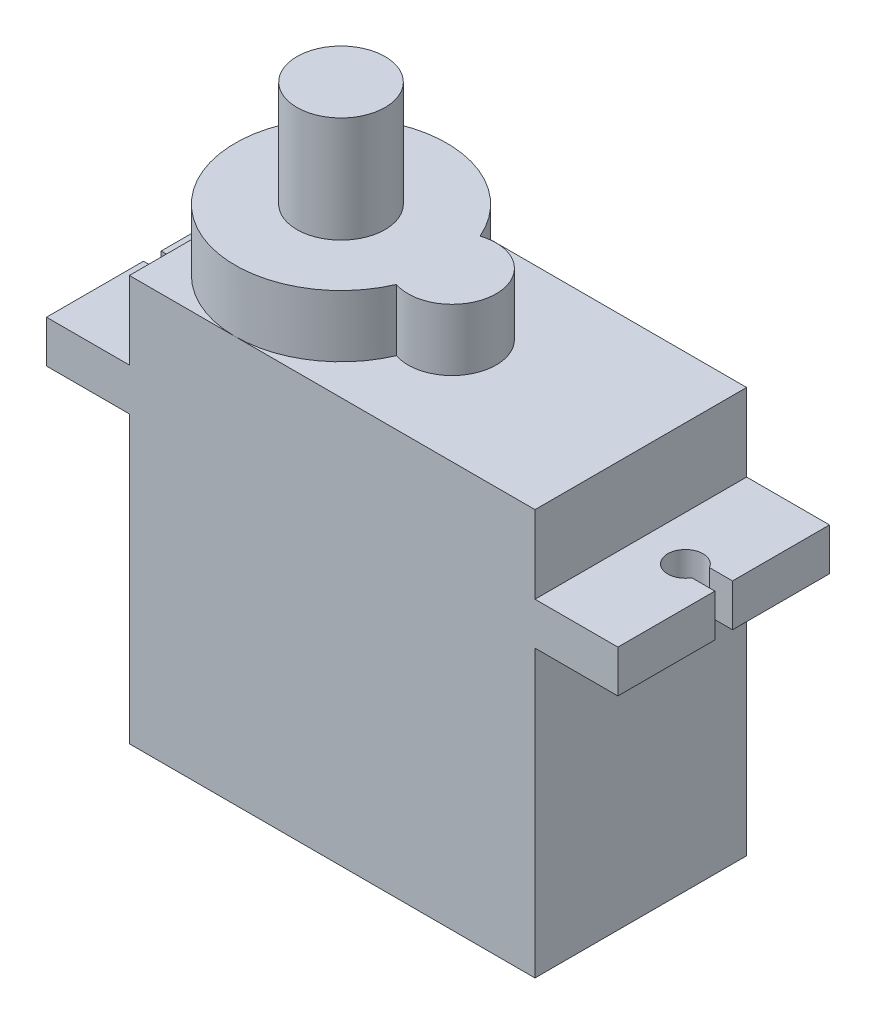
ISO-10303-21;
HEADER;
FILE_DESCRIPTION(('STEP AP214'),'2;1');
FILE_NAME('part.step','',(''),(''),'','','');
FILE_SCHEMA(('AUTOMOTIVE_DESIGN { 1 0 10303 214 1 1 1 1 }'));
ENDSEC;
DATA;
#1=APPLICATION_CONTEXT('core data for automotive mechanical design processes');
#2=APPLICATION_PROTOCOL_DEFINITION('international standard','automotive_design',2000,#1);
#3=PRODUCT_CONTEXT('',#1,'mechanical');
#4=PRODUCT('Part','Part','',(#3));
#5=PRODUCT_RELATED_PRODUCT_CATEGORY('part','',(#4));
#6=PRODUCT_DEFINITION_FORMATION('','',#4);
#7=PRODUCT_DEFINITION_CONTEXT('part definition',#1,'design');
#8=PRODUCT_DEFINITION('design','',#6,#7);
#9=PRODUCT_DEFINITION_SHAPE('','',#8);
#10=(LENGTH_UNIT() NAMED_UNIT(*) SI_UNIT(.MILLI.,.METRE.));
#11=(NAMED_UNIT(*) PLANE_ANGLE_UNIT() SI_UNIT($,.RADIAN.));
#12=(NAMED_UNIT(*) SI_UNIT($,.STERADIAN.) SOLID_ANGLE_UNIT());
#13=UNCERTAINTY_MEASURE_WITH_UNIT(LENGTH_MEASURE(1.E-05),#10,'distance_accuracy_value','');
#14=(GEOMETRIC_REPRESENTATION_CONTEXT(3) GLOBAL_UNCERTAINTY_ASSIGNED_CONTEXT((#13)) GLOBAL_UNIT_ASSIGNED_CONTEXT((#10,
#11,#12)) REPRESENTATION_CONTEXT('',''));
#15=CARTESIAN_POINT('',(0.,0.,0.));
#16=DIRECTION('',(0.,0.,1.));
#17=DIRECTION('',(1.,0.,0.));
#18=AXIS2_PLACEMENT_3D('',#15,#16,#17);
#19=CARTESIAN_POINT('',(-11.5,-23.,6.));
#20=DIRECTION('',(-1.,0.,0.));
#21=DIRECTION('',(0.,0.,1.));
#22=AXIS2_PLACEMENT_3D('',#19,#20,#21);
#23=PLANE('',#22);
#24=DIRECTION('',(0.,0.,1.));
#25=VECTOR('',#24,1.);
#26=CARTESIAN_POINT('',(-11.5,-6.8,0.));
#27=LINE('',#26,#25);
#28=CARTESIAN_POINT('',(-11.5,-6.8,-6.));
#29=VERTEX_POINT('',#28);
#30=CARTESIAN_POINT('',(-11.5,-6.8,6.));
#31=VERTEX_POINT('',#30);
#32=EDGE_CURVE('E336',#29,#31,#27,.T.);
#33=ORIENTED_EDGE('',*,*,#32,.F.);
#34=DIRECTION('',(0.,1.,0.));
#35=VECTOR('',#34,1.);
#36=CARTESIAN_POINT('',(-11.5,-23.,-6.));
#37=LINE('',#36,#35);
#38=CARTESIAN_POINT('',(-11.5,-23.,-6.));
#39=VERTEX_POINT('',#38);
#40=EDGE_CURVE('E412',#39,#29,#37,.T.);
#41=ORIENTED_EDGE('',*,*,#40,.F.);
#42=DIRECTION('',(0.,0.,1.));
#43=VECTOR('',#42,1.);
#44=CARTESIAN_POINT('',(-11.5,-23.,6.));
#45=LINE('',#44,#43);
#46=CARTESIAN_POINT('',(-11.5,-23.,6.));
#47=VERTEX_POINT('',#46);
#48=EDGE_CURVE('E385',#39,#47,#45,.T.);
#49=ORIENTED_EDGE('',*,*,#48,.T.);
#50=DIRECTION('',(0.,1.,0.));
#51=VECTOR('',#50,1.);
#52=CARTESIAN_POINT('',(-11.5,-23.,6.));
#53=LINE('',#52,#51);
#54=EDGE_CURVE('E409',#47,#31,#53,.T.);
#55=ORIENTED_EDGE('',*,*,#54,.T.);
#56=EDGE_LOOP('',(#33,#41,#49,#55));
#57=FACE_BOUND('',#56,.T.);
#58=DIRECTION('',(0.,0.,1.));
#59=VECTOR('',#58,1.);
#60=CARTESIAN_POINT('',(-11.5,-18.,-1.5));
#61=LINE('',#60,#59);
#62=CARTESIAN_POINT('',(-11.5,-18.,-1.5));
#63=VERTEX_POINT('',#62);
#64=CARTESIAN_POINT('',(-11.5,-18.,1.5));
#65=VERTEX_POINT('',#64);
#66=EDGE_CURVE('E598',#63,#65,#61,.T.);
#67=ORIENTED_EDGE('',*,*,#66,.F.);
#68=DIRECTION('',(0.,-1.,0.));
#69=VECTOR('',#68,1.);
#70=CARTESIAN_POINT('',(-11.5,-17.,-1.5));
#71=LINE('',#70,#69);
#72=CARTESIAN_POINT('',(-11.5,-17.,-1.5));
#73=VERTEX_POINT('',#72);
#74=EDGE_CURVE('E248',#73,#63,#71,.T.);
#75=ORIENTED_EDGE('',*,*,#74,.F.);
#76=DIRECTION('',(0.,0.,-1.));
#77=VECTOR('',#76,1.);
#78=CARTESIAN_POINT('',(-11.5,-17.,-1.5));
#79=LINE('',#78,#77);
#80=CARTESIAN_POINT('',(-11.5,-17.,1.5));
#81=VERTEX_POINT('',#80);
#82=EDGE_CURVE('E244',#81,#73,#79,.T.);
#83=ORIENTED_EDGE('',*,*,#82,.F.);
#84=DIRECTION('',(0.,1.,0.));
#85=VECTOR('',#84,1.);
#86=CARTESIAN_POINT('',(-11.5,-17.,1.5));
#87=LINE('',#86,#85);
#88=EDGE_CURVE('E605',#65,#81,#87,.T.);
#89=ORIENTED_EDGE('',*,*,#88,.F.);
#90=EDGE_LOOP('',(#67,#75,#83,#89));
#91=FACE_BOUND('',#90,.T.);
#92=ADVANCED_FACE('F43',(#57,#91),#23,.T.);
#93=CARTESIAN_POINT('',(0.,3.5,0.));
#94=DIRECTION('',(0.,1.,0.));
#95=DIRECTION('',(0.,0.,1.));
#96=AXIS2_PLACEMENT_3D('',#93,#94,#95);
#97=PLANE('',#96);
#98=CARTESIAN_POINT('',(-5.5,3.5,0.));
#99=DIRECTION('',(0.,1.,0.));
#100=DIRECTION('',(0.,0.,1.));
#101=AXIS2_PLACEMENT_3D('',#98,#99,#100);
#102=CIRCLE('',#101,2.5);
#103=CARTESIAN_POINT('',(-5.5,3.5,2.5));
#104=VERTEX_POINT('',#103);
#105=EDGE_CURVE('E11',#104,#104,#102,.T.);
#106=ORIENTED_EDGE('',*,*,#105,.F.);
#107=EDGE_LOOP('',(#106));
#108=FACE_BOUND('',#107,.T.);
#109=CARTESIAN_POINT('',(-5.5,3.5,0.));
#110=DIRECTION('',(0.,1.,0.));
#111=DIRECTION('',(0.,0.,1.));
#112=AXIS2_PLACEMENT_3D('',#109,#110,#111);
#113=CIRCLE('',#112,6.);
#114=CARTESIAN_POINT('',(0.0111111111111162,3.5,-2.37226775912578));
#115=VERTEX_POINT('',#114);
#116=CARTESIAN_POINT('',(0.0111111111111162,3.5,2.37226775912578));
#117=VERTEX_POINT('',#116);
#118=EDGE_CURVE('E258',#115,#117,#113,.T.);
#119=ORIENTED_EDGE('',*,*,#118,.T.);
#120=CARTESIAN_POINT('',(0.800000000000004,3.5,0.));
#121=DIRECTION('',(0.,1.,0.));
#122=DIRECTION('',(0.,0.,1.));
#123=AXIS2_PLACEMENT_3D('',#120,#121,#122);
#124=CIRCLE('',#123,2.5);
#125=EDGE_CURVE('E261',#117,#115,#124,.T.);
#126=ORIENTED_EDGE('',*,*,#125,.T.);
#127=EDGE_LOOP('',(#119,#126));
#128=FACE_BOUND('',#127,.T.);
#129=ADVANCED_FACE('F498',(#108,#128),#97,.T.);
#130=CARTESIAN_POINT('',(0.,0.,0.));
#131=DIRECTION('',(0.,-1.,0.));
#132=DIRECTION('',(0.,0.,-1.));
#133=AXIS2_PLACEMENT_3D('',#130,#131,#132);
#134=PLANE('',#133);
#135=CARTESIAN_POINT('',(-5.5,0.,0.));
#136=DIRECTION('',(0.,1.,0.));
#137=DIRECTION('',(0.,0.,1.));
#138=AXIS2_PLACEMENT_3D('',#135,#136,#137);
#139=CIRCLE('',#138,6.);
#140=CARTESIAN_POINT('',(0.0111111111111162,0.,-2.37226775912578));
#141=VERTEX_POINT('',#140);
#142=CARTESIAN_POINT('',(-5.5,0.,-6.));
#143=VERTEX_POINT('',#142);
#144=EDGE_CURVE('E250',#141,#143,#139,.T.);
#145=ORIENTED_EDGE('',*,*,#144,.F.);
#146=CARTESIAN_POINT('',(0.800000000000004,0.,0.));
#147=DIRECTION('',(0.,1.,0.));
#148=DIRECTION('',(0.,0.,1.));
#149=AXIS2_PLACEMENT_3D('',#146,#147,#148);
#150=CIRCLE('',#149,2.5);
#151=CARTESIAN_POINT('',(0.0111111111111162,0.,2.37226775912578));
#152=VERTEX_POINT('',#151);
#153=EDGE_CURVE('E66',#152,#141,#150,.T.);
#154=ORIENTED_EDGE('',*,*,#153,.F.);
#155=CARTESIAN_POINT('',(-5.5,0.,6.));
#156=VERTEX_POINT('',#155);
#157=EDGE_CURVE('E254',#156,#152,#139,.T.);
#158=ORIENTED_EDGE('',*,*,#157,.F.);
#159=DIRECTION('',(1.,0.,0.));
#160=VECTOR('',#159,1.);
#161=CARTESIAN_POINT('',(-11.5,0.,6.));
#162=LINE('',#161,#160);
#163=CARTESIAN_POINT('',(11.5,0.,6.));
#164=VERTEX_POINT('',#163);
#165=EDGE_CURVE('E402',#156,#164,#162,.T.);
#166=ORIENTED_EDGE('',*,*,#165,.T.);
#167=DIRECTION('',(0.,0.,-1.));
#168=VECTOR('',#167,1.);
#169=CARTESIAN_POINT('',(11.5,0.,6.));
#170=LINE('',#169,#168);
#171=CARTESIAN_POINT('',(11.5,0.,-6.));
#172=VERTEX_POINT('',#171);
#173=EDGE_CURVE('E366',#164,#172,#170,.T.);
#174=ORIENTED_EDGE('',*,*,#173,.T.);
#175=DIRECTION('',(-1.,0.,0.));
#176=VECTOR('',#175,1.);
#177=CARTESIAN_POINT('',(-11.5,0.,-6.));
#178=LINE('',#177,#176);
#179=EDGE_CURVE('E395',#172,#143,#178,.T.);
#180=ORIENTED_EDGE('',*,*,#179,.T.);
#181=EDGE_LOOP('',(#145,#154,#158,#166,#174,#180));
#182=FACE_BOUND('',#181,.T.);
#183=ADVANCED_FACE('F428',(#182),#134,.F.);
#184=CARTESIAN_POINT('',(-11.5,0.,0.));
#185=VERTEX_POINT('',#184);
#186=EDGE_CURVE('E51',#143,#185,#139,.T.);
#187=ORIENTED_EDGE('',*,*,#186,.F.);
#188=CARTESIAN_POINT('',(-11.5,0.,-6.));
#189=VERTEX_POINT('',#188);
#190=EDGE_CURVE('E394',#143,#189,#178,.T.);
#191=ORIENTED_EDGE('',*,*,#190,.T.);
#192=DIRECTION('',(0.,0.,1.));
#193=VECTOR('',#192,1.);
#194=CARTESIAN_POINT('',(-11.5,0.,6.));
#195=LINE('',#194,#193);
#196=EDGE_CURVE('E399',#189,#185,#195,.T.);
#197=ORIENTED_EDGE('',*,*,#196,.T.);
#198=EDGE_LOOP('',(#187,#191,#197));
#199=FACE_BOUND('',#198,.T.);
#200=ADVANCED_FACE('F491',(#199),#134,.F.);
#201=CARTESIAN_POINT('',(11.5,-23.,6.));
#202=DIRECTION('',(1.,0.,0.));
#203=DIRECTION('',(0.,0.,-1.));
#204=AXIS2_PLACEMENT_3D('',#201,#202,#203);
#205=PLANE('',#204);
#206=DIRECTION('',(0.,1.,0.));
#207=VECTOR('',#206,1.);
#208=CARTESIAN_POINT('',(11.5,-23.,6.));
#209=LINE('',#208,#207);
#210=CARTESIAN_POINT('',(11.5,-4.4,6.));
#211=VERTEX_POINT('',#210);
#212=EDGE_CURVE('E408',#211,#164,#209,.T.);
#213=ORIENTED_EDGE('',*,*,#212,.F.);
#214=DIRECTION('',(0.,0.,-1.));
#215=VECTOR('',#214,1.);
#216=CARTESIAN_POINT('',(11.5,-4.4,0.));
#217=LINE('',#216,#215);
#218=CARTESIAN_POINT('',(11.5,-4.4,-6.));
#219=VERTEX_POINT('',#218);
#220=EDGE_CURVE('E303',#211,#219,#217,.T.);
#221=ORIENTED_EDGE('',*,*,#220,.T.);
#222=DIRECTION('',(0.,1.,0.));
#223=VECTOR('',#222,1.);
#224=CARTESIAN_POINT('',(11.5,-23.,-6.));
#225=LINE('',#224,#223);
#226=EDGE_CURVE('E391',#219,#172,#225,.T.);
#227=ORIENTED_EDGE('',*,*,#226,.T.);
#228=ORIENTED_EDGE('',*,*,#173,.F.);
#229=EDGE_LOOP('',(#213,#221,#227,#228));
#230=FACE_BOUND('',#229,.T.);
#231=ADVANCED_FACE('F422',(#230),#205,.T.);
#232=CARTESIAN_POINT('',(-11.5,-4.4,-6.));
#233=VERTEX_POINT('',#232);
#234=EDGE_CURVE('E414',#233,#189,#37,.T.);
#235=ORIENTED_EDGE('',*,*,#234,.F.);
#236=DIRECTION('',(0.,0.,1.));
#237=VECTOR('',#236,1.);
#238=CARTESIAN_POINT('',(-11.5,-4.4,0.));
#239=LINE('',#238,#237);
#240=CARTESIAN_POINT('',(-11.5,-4.4,6.));
#241=VERTEX_POINT('',#240);
#242=EDGE_CURVE('E357',#233,#241,#239,.T.);
#243=ORIENTED_EDGE('',*,*,#242,.T.);
#244=CARTESIAN_POINT('',(-11.5,0.,6.));
#245=VERTEX_POINT('',#244);
#246=EDGE_CURVE('E411',#241,#245,#53,.T.);
#247=ORIENTED_EDGE('',*,*,#246,.T.);
#248=EDGE_CURVE('E398',#185,#245,#195,.T.);
#249=ORIENTED_EDGE('',*,*,#248,.F.);
#250=ORIENTED_EDGE('',*,*,#196,.F.);
#251=EDGE_LOOP('',(#235,#243,#247,#249,#250));
#252=FACE_BOUND('',#251,.T.);
#253=ADVANCED_FACE('F479',(#252),#23,.T.);
#254=DIRECTION('',(0.,0.,-1.));
#255=VECTOR('',#254,1.);
#256=CARTESIAN_POINT('',(11.5,-6.8,0.));
#257=LINE('',#256,#255);
#258=CARTESIAN_POINT('',(11.5,-6.8,6.));
#259=VERTEX_POINT('',#258);
#260=CARTESIAN_POINT('',(11.5,-6.8,-6.));
#261=VERTEX_POINT('',#260);
#262=EDGE_CURVE('E282',#259,#261,#257,.T.);
#263=ORIENTED_EDGE('',*,*,#262,.F.);
#264=CARTESIAN_POINT('',(11.5,-23.,6.));
#265=VERTEX_POINT('',#264);
#266=EDGE_CURVE('E405',#265,#259,#209,.T.);
#267=ORIENTED_EDGE('',*,*,#266,.F.);
#268=DIRECTION('',(0.,0.,-1.));
#269=VECTOR('',#268,1.);
#270=CARTESIAN_POINT('',(11.5,-23.,6.));
#271=LINE('',#270,#269);
#272=CARTESIAN_POINT('',(11.5,-23.,-6.));
#273=VERTEX_POINT('',#272);
#274=EDGE_CURVE('E378',#265,#273,#271,.T.);
#275=ORIENTED_EDGE('',*,*,#274,.T.);
#276=EDGE_CURVE('E415',#273,#261,#225,.T.);
#277=ORIENTED_EDGE('',*,*,#276,.T.);
#278=EDGE_LOOP('',(#263,#267,#275,#277));
#279=FACE_BOUND('',#278,.T.);
#280=ADVANCED_FACE('F45',(#279),#205,.T.);
#281=CARTESIAN_POINT('',(-11.5,-23.,6.));
#282=DIRECTION('',(0.,0.,1.));
#283=DIRECTION('',(1.,0.,0.));
#284=AXIS2_PLACEMENT_3D('',#281,#282,#283);
#285=PLANE('',#284);
#286=EDGE_CURVE('E382',#245,#156,#162,.T.);
#287=ORIENTED_EDGE('',*,*,#286,.F.);
#288=ORIENTED_EDGE('',*,*,#246,.F.);
#289=DIRECTION('',(1.,0.,0.));
#290=VECTOR('',#289,1.);
#291=CARTESIAN_POINT('',(0.,-4.4,6.));
#292=LINE('',#291,#290);
#293=CARTESIAN_POINT('',(-16.2,-4.4,6.));
#294=VERTEX_POINT('',#293);
#295=EDGE_CURVE('E353',#294,#241,#292,.T.);
#296=ORIENTED_EDGE('',*,*,#295,.F.);
#297=DIRECTION('',(0.,1.,0.));
#298=VECTOR('',#297,1.);
#299=CARTESIAN_POINT('',(-16.2,-6.8,6.));
#300=LINE('',#299,#298);
#301=CARTESIAN_POINT('',(-16.2,-6.8,6.));
#302=VERTEX_POINT('',#301);
#303=EDGE_CURVE('E373',#302,#294,#300,.T.);
#304=ORIENTED_EDGE('',*,*,#303,.F.);
#305=DIRECTION('',(1.,0.,0.));
#306=VECTOR('',#305,1.);
#307=CARTESIAN_POINT('',(0.,-6.8,6.));
#308=LINE('',#307,#306);
#309=EDGE_CURVE('E332',#302,#31,#308,.T.);
#310=ORIENTED_EDGE('',*,*,#309,.T.);
#311=ORIENTED_EDGE('',*,*,#54,.F.);
#312=DIRECTION('',(1.,0.,0.));
#313=VECTOR('',#312,1.);
#314=CARTESIAN_POINT('',(-11.5,-23.,6.));
#315=LINE('',#314,#313);
#316=EDGE_CURVE('E388',#47,#265,#315,.T.);
#317=ORIENTED_EDGE('',*,*,#316,.T.);
#318=ORIENTED_EDGE('',*,*,#266,.T.);
#319=DIRECTION('',(1.,0.,0.));
#320=VECTOR('',#319,1.);
#321=CARTESIAN_POINT('',(0.,-6.8,6.));
#322=LINE('',#321,#320);
#323=CARTESIAN_POINT('',(16.2,-6.8,6.));
#324=VERTEX_POINT('',#323);
#325=EDGE_CURVE('E285',#259,#324,#322,.T.);
#326=ORIENTED_EDGE('',*,*,#325,.T.);
#327=DIRECTION('',(0.,1.,0.));
#328=VECTOR('',#327,1.);
#329=CARTESIAN_POINT('',(16.2,-6.8,6.));
#330=LINE('',#329,#328);
#331=CARTESIAN_POINT('',(16.2,-4.4,6.));
#332=VERTEX_POINT('',#331);
#333=EDGE_CURVE('E315',#324,#332,#330,.T.);
#334=ORIENTED_EDGE('',*,*,#333,.T.);
#335=DIRECTION('',(1.,0.,0.));
#336=VECTOR('',#335,1.);
#337=CARTESIAN_POINT('',(0.,-4.4,6.));
#338=LINE('',#337,#336);
#339=EDGE_CURVE('E305',#211,#332,#338,.T.);
#340=ORIENTED_EDGE('',*,*,#339,.F.);
#341=ORIENTED_EDGE('',*,*,#212,.T.);
#342=ORIENTED_EDGE('',*,*,#165,.F.);
#343=EDGE_LOOP('',(#287,#288,#296,#304,#310,#311,#317,#318,#326,#334,#340,#341,#342));
#344=FACE_BOUND('',#343,.T.);
#345=ADVANCED_FACE('F434',(#344),#285,.T.);
#346=CARTESIAN_POINT('',(-11.5,-23.,-6.));
#347=DIRECTION('',(0.,0.,-1.));
#348=DIRECTION('',(-1.,0.,0.));
#349=AXIS2_PLACEMENT_3D('',#346,#347,#348);
#350=PLANE('',#349);
#351=ORIENTED_EDGE('',*,*,#179,.F.);
#352=ORIENTED_EDGE('',*,*,#226,.F.);
#353=DIRECTION('',(1.,0.,0.));
#354=VECTOR('',#353,1.);
#355=CARTESIAN_POINT('',(0.,-4.4,-6.));
#356=LINE('',#355,#354);
#357=CARTESIAN_POINT('',(16.2,-4.4,-6.));
#358=VERTEX_POINT('',#357);
#359=EDGE_CURVE('E299',#219,#358,#356,.T.);
#360=ORIENTED_EDGE('',*,*,#359,.T.);
#361=DIRECTION('',(0.,1.,0.));
#362=VECTOR('',#361,1.);
#363=CARTESIAN_POINT('',(16.2,-6.8,-6.));
#364=LINE('',#363,#362);
#365=CARTESIAN_POINT('',(16.2,-6.8,-6.));
#366=VERTEX_POINT('',#365);
#367=EDGE_CURVE('E317',#366,#358,#364,.T.);
#368=ORIENTED_EDGE('',*,*,#367,.F.);
#369=DIRECTION('',(1.,0.,0.));
#370=VECTOR('',#369,1.);
#371=CARTESIAN_POINT('',(0.,-6.8,-6.));
#372=LINE('',#371,#370);
#373=EDGE_CURVE('E279',#261,#366,#372,.T.);
#374=ORIENTED_EDGE('',*,*,#373,.F.);
#375=ORIENTED_EDGE('',*,*,#276,.F.);
#376=DIRECTION('',(-1.,0.,0.));
#377=VECTOR('',#376,1.);
#378=CARTESIAN_POINT('',(-11.5,-23.,-6.));
#379=LINE('',#378,#377);
#380=EDGE_CURVE('E381',#273,#39,#379,.T.);
#381=ORIENTED_EDGE('',*,*,#380,.T.);
#382=ORIENTED_EDGE('',*,*,#40,.T.);
#383=DIRECTION('',(1.,0.,0.));
#384=VECTOR('',#383,1.);
#385=CARTESIAN_POINT('',(0.,-6.8,-6.));
#386=LINE('',#385,#384);
#387=CARTESIAN_POINT('',(-16.2,-6.8,-6.));
#388=VERTEX_POINT('',#387);
#389=EDGE_CURVE('E339',#388,#29,#386,.T.);
#390=ORIENTED_EDGE('',*,*,#389,.F.);
#391=DIRECTION('',(0.,1.,0.));
#392=VECTOR('',#391,1.);
#393=CARTESIAN_POINT('',(-16.2,-6.8,-6.));
#394=LINE('',#393,#392);
#395=CARTESIAN_POINT('',(-16.2,-4.4,-6.));
#396=VERTEX_POINT('',#395);
#397=EDGE_CURVE('E370',#388,#396,#394,.T.);
#398=ORIENTED_EDGE('',*,*,#397,.T.);
#399=DIRECTION('',(1.,0.,0.));
#400=VECTOR('',#399,1.);
#401=CARTESIAN_POINT('',(0.,-4.4,-6.));
#402=LINE('',#401,#400);
#403=EDGE_CURVE('E359',#396,#233,#402,.T.);
#404=ORIENTED_EDGE('',*,*,#403,.T.);
#405=ORIENTED_EDGE('',*,*,#234,.T.);
#406=ORIENTED_EDGE('',*,*,#190,.F.);
#407=EDGE_LOOP('',(#351,#352,#360,#368,#374,#375,#381,#382,#390,#398,#404,#405,#406));
#408=FACE_BOUND('',#407,.T.);
#409=ADVANCED_FACE('F427',(#408),#350,.T.);
#410=CARTESIAN_POINT('',(0.,-23.,0.));
#411=DIRECTION('',(0.,-1.,0.));
#412=DIRECTION('',(0.,0.,-1.));
#413=AXIS2_PLACEMENT_3D('',#410,#411,#412);
#414=PLANE('',#413);
#415=ORIENTED_EDGE('',*,*,#274,.F.);
#416=ORIENTED_EDGE('',*,*,#316,.F.);
#417=ORIENTED_EDGE('',*,*,#48,.F.);
#418=ORIENTED_EDGE('',*,*,#380,.F.);
#419=EDGE_LOOP('',(#415,#416,#417,#418));
#420=FACE_BOUND('',#419,.T.);
#421=ADVANCED_FACE('F456',(#420),#414,.T.);
#422=EDGE_CURVE('E485',#185,#156,#139,.T.);
#423=ORIENTED_EDGE('',*,*,#422,.F.);
#424=ORIENTED_EDGE('',*,*,#248,.T.);
#425=ORIENTED_EDGE('',*,*,#286,.T.);
#426=EDGE_LOOP('',(#423,#424,#425));
#427=FACE_BOUND('',#426,.T.);
#428=ADVANCED_FACE('F484',(#427),#134,.F.);
#429=CARTESIAN_POINT('',(-14.7182683390567,-6.8,0.));
#430=DIRECTION('',(0.,1.,0.));
#431=DIRECTION('',(0.,0.,1.));
#432=AXIS2_PLACEMENT_3D('',#429,#430,#431);
#433=CYLINDRICAL_SURFACE('',#432,1.);
#434=CARTESIAN_POINT('',(-14.7182683390567,-4.4,0.));
#435=DIRECTION('',(0.,1.,0.));
#436=DIRECTION('',(0.,0.,1.));
#437=AXIS2_PLACEMENT_3D('',#434,#435,#436);
#438=CIRCLE('',#437,1.);
#439=CARTESIAN_POINT('',(-15.5842937428412,-4.4,0.5));
#440=VERTEX_POINT('',#439);
#441=CARTESIAN_POINT('',(-15.5842937428412,-4.4,-0.5));
#442=VERTEX_POINT('',#441);
#443=EDGE_CURVE('E312',#440,#442,#438,.T.);
#444=ORIENTED_EDGE('',*,*,#443,.T.);
#445=DIRECTION('',(0.,1.,0.));
#446=VECTOR('',#445,1.);
#447=CARTESIAN_POINT('',(-15.5842937428412,-6.8,-0.5));
#448=LINE('',#447,#446);
#449=CARTESIAN_POINT('',(-15.5842937428412,-6.8,-0.5));
#450=VERTEX_POINT('',#449);
#451=EDGE_CURVE('E363',#450,#442,#448,.T.);
#452=ORIENTED_EDGE('',*,*,#451,.F.);
#453=CARTESIAN_POINT('',(-14.7182683390567,-6.8,0.));
#454=DIRECTION('',(0.,1.,0.));
#455=DIRECTION('',(0.,0.,1.));
#456=AXIS2_PLACEMENT_3D('',#453,#454,#455);
#457=CIRCLE('',#456,1.);
#458=CARTESIAN_POINT('',(-15.5842937428412,-6.8,0.5));
#459=VERTEX_POINT('',#458);
#460=EDGE_CURVE('E323',#459,#450,#457,.T.);
#461=ORIENTED_EDGE('',*,*,#460,.F.);
#462=DIRECTION('',(0.,1.,0.));
#463=VECTOR('',#462,1.);
#464=CARTESIAN_POINT('',(-15.5842937428412,-6.8,0.5));
#465=LINE('',#464,#463);
#466=EDGE_CURVE('E344',#459,#440,#465,.T.);
#467=ORIENTED_EDGE('',*,*,#466,.T.);
#468=EDGE_LOOP('',(#444,#452,#461,#467));
#469=FACE_BOUND('',#468,.T.);
#470=ADVANCED_FACE('F502',(#469),#433,.F.);
#471=CARTESIAN_POINT('',(0.,-6.8,-0.500000000000003));
#472=DIRECTION('',(0.,0.,-1.));
#473=DIRECTION('',(-1.,0.,0.));
#474=AXIS2_PLACEMENT_3D('',#471,#472,#473);
#475=PLANE('',#474);
#476=DIRECTION('',(-1.,0.,0.));
#477=VECTOR('',#476,1.);
#478=CARTESIAN_POINT('',(0.,-4.4,-0.500000000000003));
#479=LINE('',#478,#477);
#480=CARTESIAN_POINT('',(-16.2,-4.4,-0.5));
#481=VERTEX_POINT('',#480);
#482=EDGE_CURVE('E327',#442,#481,#479,.T.);
#483=ORIENTED_EDGE('',*,*,#482,.T.);
#484=DIRECTION('',(0.,1.,0.));
#485=VECTOR('',#484,1.);
#486=CARTESIAN_POINT('',(-16.2,-6.8,-0.5));
#487=LINE('',#486,#485);
#488=CARTESIAN_POINT('',(-16.2,-6.8,-0.5));
#489=VERTEX_POINT('',#488);
#490=EDGE_CURVE('E367',#489,#481,#487,.T.);
#491=ORIENTED_EDGE('',*,*,#490,.F.);
#492=DIRECTION('',(-1.,0.,0.));
#493=VECTOR('',#492,1.);
#494=CARTESIAN_POINT('',(0.,-6.8,-0.500000000000003));
#495=LINE('',#494,#493);
#496=EDGE_CURVE('E342',#450,#489,#495,.T.);
#497=ORIENTED_EDGE('',*,*,#496,.F.);
#498=ORIENTED_EDGE('',*,*,#451,.T.);
#499=EDGE_LOOP('',(#483,#491,#497,#498));
#500=FACE_BOUND('',#499,.T.);
#501=ADVANCED_FACE('F529',(#500),#475,.F.);
#502=CARTESIAN_POINT('',(-16.2,-6.8,0.));
#503=DIRECTION('',(1.,0.,0.));
#504=DIRECTION('',(0.,0.,-1.));
#505=AXIS2_PLACEMENT_3D('',#502,#503,#504);
#506=PLANE('',#505);
#507=DIRECTION('',(0.,0.,-1.));
#508=VECTOR('',#507,1.);
#509=CARTESIAN_POINT('',(-16.2,-4.4,0.));
#510=LINE('',#509,#508);
#511=EDGE_CURVE('E354',#481,#396,#510,.T.);
#512=ORIENTED_EDGE('',*,*,#511,.T.);
#513=ORIENTED_EDGE('',*,*,#397,.F.);
#514=DIRECTION('',(0.,0.,-1.));
#515=VECTOR('',#514,1.);
#516=CARTESIAN_POINT('',(-16.2,-6.8,0.));
#517=LINE('',#516,#515);
#518=EDGE_CURVE('E333',#489,#388,#517,.T.);
#519=ORIENTED_EDGE('',*,*,#518,.F.);
#520=ORIENTED_EDGE('',*,*,#490,.T.);
#521=EDGE_LOOP('',(#512,#513,#519,#520));
#522=FACE_BOUND('',#521,.T.);
#523=ADVANCED_FACE('F467',(#522),#506,.F.);
#524=CARTESIAN_POINT('',(-16.2,-4.4,0.5));
#525=VERTEX_POINT('',#524);
#526=EDGE_CURVE('E350',#294,#525,#510,.T.);
#527=ORIENTED_EDGE('',*,*,#526,.T.);
#528=DIRECTION('',(0.,1.,0.));
#529=VECTOR('',#528,1.);
#530=CARTESIAN_POINT('',(-16.2,-6.8,0.5));
#531=LINE('',#530,#529);
#532=CARTESIAN_POINT('',(-16.2,-6.8,0.5));
#533=VERTEX_POINT('',#532);
#534=EDGE_CURVE('E375',#533,#525,#531,.T.);
#535=ORIENTED_EDGE('',*,*,#534,.F.);
#536=EDGE_CURVE('E330',#302,#533,#517,.T.);
#537=ORIENTED_EDGE('',*,*,#536,.F.);
#538=ORIENTED_EDGE('',*,*,#303,.T.);
#539=EDGE_LOOP('',(#527,#535,#537,#538));
#540=FACE_BOUND('',#539,.T.);
#541=ADVANCED_FACE('F534',(#540),#506,.F.);
#542=CARTESIAN_POINT('',(0.,-6.8,0.500000000000003));
#543=DIRECTION('',(0.,0.,-1.));
#544=DIRECTION('',(-1.,0.,0.));
#545=AXIS2_PLACEMENT_3D('',#542,#543,#544);
#546=PLANE('',#545);
#547=DIRECTION('',(-1.,0.,0.));
#548=VECTOR('',#547,1.);
#549=CARTESIAN_POINT('',(0.,-4.4,0.500000000000003));
#550=LINE('',#549,#548);
#551=EDGE_CURVE('E347',#440,#525,#550,.T.);
#552=ORIENTED_EDGE('',*,*,#551,.F.);
#553=ORIENTED_EDGE('',*,*,#466,.F.);
#554=DIRECTION('',(-1.,0.,0.));
#555=VECTOR('',#554,1.);
#556=CARTESIAN_POINT('',(0.,-6.8,0.500000000000003));
#557=LINE('',#556,#555);
#558=EDGE_CURVE('E326',#459,#533,#557,.T.);
#559=ORIENTED_EDGE('',*,*,#558,.T.);
#560=ORIENTED_EDGE('',*,*,#534,.T.);
#561=EDGE_LOOP('',(#552,#553,#559,#560));
#562=FACE_BOUND('',#561,.T.);
#563=ADVANCED_FACE('F531',(#562),#546,.T.);
#564=CARTESIAN_POINT('',(0.,-6.8,0.));
#565=DIRECTION('',(0.,1.,0.));
#566=DIRECTION('',(0.,0.,1.));
#567=AXIS2_PLACEMENT_3D('',#564,#565,#566);
#568=PLANE('',#567);
#569=ORIENTED_EDGE('',*,*,#460,.T.);
#570=ORIENTED_EDGE('',*,*,#496,.T.);
#571=ORIENTED_EDGE('',*,*,#518,.T.);
#572=ORIENTED_EDGE('',*,*,#389,.T.);
#573=ORIENTED_EDGE('',*,*,#32,.T.);
#574=ORIENTED_EDGE('',*,*,#309,.F.);
#575=ORIENTED_EDGE('',*,*,#536,.T.);
#576=ORIENTED_EDGE('',*,*,#558,.F.);
#577=EDGE_LOOP('',(#569,#570,#571,#572,#573,#574,#575,#576));
#578=FACE_BOUND('',#577,.T.);
#579=ADVANCED_FACE('F461',(#578),#568,.F.);
#580=CARTESIAN_POINT('',(0.,-4.4,0.));
#581=DIRECTION('',(0.,1.,0.));
#582=DIRECTION('',(0.,0.,1.));
#583=AXIS2_PLACEMENT_3D('',#580,#581,#582);
#584=PLANE('',#583);
#585=ORIENTED_EDGE('',*,*,#443,.F.);
#586=ORIENTED_EDGE('',*,*,#551,.T.);
#587=ORIENTED_EDGE('',*,*,#526,.F.);
#588=ORIENTED_EDGE('',*,*,#295,.T.);
#589=ORIENTED_EDGE('',*,*,#242,.F.);
#590=ORIENTED_EDGE('',*,*,#403,.F.);
#591=ORIENTED_EDGE('',*,*,#511,.F.);
#592=ORIENTED_EDGE('',*,*,#482,.F.);
#593=EDGE_LOOP('',(#585,#586,#587,#588,#589,#590,#591,#592));
#594=FACE_BOUND('',#593,.T.);
#595=ADVANCED_FACE('F473',(#594),#584,.T.);
#596=CARTESIAN_POINT('',(14.0283546303813,-6.8,0.));
#597=DIRECTION('',(0.,1.,0.));
#598=DIRECTION('',(0.,0.,1.));
#599=AXIS2_PLACEMENT_3D('',#596,#597,#598);
#600=CYLINDRICAL_SURFACE('',#599,1.);
#601=CARTESIAN_POINT('',(14.0283546303813,-4.4,0.));
#602=DIRECTION('',(0.,1.,0.));
#603=DIRECTION('',(0.,0.,1.));
#604=AXIS2_PLACEMENT_3D('',#601,#602,#603);
#605=CIRCLE('',#604,1.);
#606=CARTESIAN_POINT('',(14.8943800341658,-4.4,-0.5));
#607=VERTEX_POINT('',#606);
#608=CARTESIAN_POINT('',(14.8943800341658,-4.4,0.5));
#609=VERTEX_POINT('',#608);
#610=EDGE_CURVE('E270',#607,#609,#605,.T.);
#611=ORIENTED_EDGE('',*,*,#610,.T.);
#612=DIRECTION('',(0.,1.,0.));
#613=VECTOR('',#612,1.);
#614=CARTESIAN_POINT('',(14.8943800341658,-6.8,0.5));
#615=LINE('',#614,#613);
#616=CARTESIAN_POINT('',(14.8943800341658,-6.8,0.5));
#617=VERTEX_POINT('',#616);
#618=EDGE_CURVE('E310',#617,#609,#615,.T.);
#619=ORIENTED_EDGE('',*,*,#618,.F.);
#620=CARTESIAN_POINT('',(14.0283546303813,-6.8,0.));
#621=DIRECTION('',(0.,1.,0.));
#622=DIRECTION('',(0.,0.,1.));
#623=AXIS2_PLACEMENT_3D('',#620,#621,#622);
#624=CIRCLE('',#623,1.);
#625=CARTESIAN_POINT('',(14.8943800341658,-6.8,-0.5));
#626=VERTEX_POINT('',#625);
#627=EDGE_CURVE('E271',#626,#617,#624,.T.);
#628=ORIENTED_EDGE('',*,*,#627,.F.);
#629=DIRECTION('',(0.,1.,0.));
#630=VECTOR('',#629,1.);
#631=CARTESIAN_POINT('',(14.8943800341658,-6.8,-0.5));
#632=LINE('',#631,#630);
#633=EDGE_CURVE('E291',#626,#607,#632,.T.);
#634=ORIENTED_EDGE('',*,*,#633,.T.);
#635=EDGE_LOOP('',(#611,#619,#628,#634));
#636=FACE_BOUND('',#635,.T.);
#637=ADVANCED_FACE('F543',(#636),#600,.F.);
#638=CARTESIAN_POINT('',(0.,-6.8,0.499999999999996));
#639=DIRECTION('',(0.,0.,-1.));
#640=DIRECTION('',(-1.,0.,0.));
#641=AXIS2_PLACEMENT_3D('',#638,#639,#640);
#642=PLANE('',#641);
#643=DIRECTION('',(-1.,0.,0.));
#644=VECTOR('',#643,1.);
#645=CARTESIAN_POINT('',(0.,-4.4,0.499999999999996));
#646=LINE('',#645,#644);
#647=CARTESIAN_POINT('',(16.2,-4.4,0.5));
#648=VERTEX_POINT('',#647);
#649=EDGE_CURVE('E274',#648,#609,#646,.T.);
#650=ORIENTED_EDGE('',*,*,#649,.F.);
#651=DIRECTION('',(0.,1.,0.));
#652=VECTOR('',#651,1.);
#653=CARTESIAN_POINT('',(16.2,-6.8,0.5));
#654=LINE('',#653,#652);
#655=CARTESIAN_POINT('',(16.2,-6.8,0.5));
#656=VERTEX_POINT('',#655);
#657=EDGE_CURVE('E313',#656,#648,#654,.T.);
#658=ORIENTED_EDGE('',*,*,#657,.F.);
#659=DIRECTION('',(-1.,0.,0.));
#660=VECTOR('',#659,1.);
#661=CARTESIAN_POINT('',(0.,-6.8,0.499999999999996));
#662=LINE('',#661,#660);
#663=EDGE_CURVE('E288',#656,#617,#662,.T.);
#664=ORIENTED_EDGE('',*,*,#663,.T.);
#665=ORIENTED_EDGE('',*,*,#618,.T.);
#666=EDGE_LOOP('',(#650,#658,#664,#665));
#667=FACE_BOUND('',#666,.T.);
#668=ADVANCED_FACE('F548',(#667),#642,.T.);
#669=CARTESIAN_POINT('',(16.2,-6.8,0.));
#670=DIRECTION('',(1.,0.,0.));
#671=DIRECTION('',(0.,0.,-1.));
#672=AXIS2_PLACEMENT_3D('',#669,#670,#671);
#673=PLANE('',#672);
#674=DIRECTION('',(0.,0.,-1.));
#675=VECTOR('',#674,1.);
#676=CARTESIAN_POINT('',(16.2,-4.4,0.));
#677=LINE('',#676,#675);
#678=EDGE_CURVE('E300',#332,#648,#677,.T.);
#679=ORIENTED_EDGE('',*,*,#678,.F.);
#680=ORIENTED_EDGE('',*,*,#333,.F.);
#681=DIRECTION('',(0.,0.,-1.));
#682=VECTOR('',#681,1.);
#683=CARTESIAN_POINT('',(16.2,-6.8,0.));
#684=LINE('',#683,#682);
#685=EDGE_CURVE('E280',#324,#656,#684,.T.);
#686=ORIENTED_EDGE('',*,*,#685,.T.);
#687=ORIENTED_EDGE('',*,*,#657,.T.);
#688=EDGE_LOOP('',(#679,#680,#686,#687));
#689=FACE_BOUND('',#688,.T.);
#690=ADVANCED_FACE('F554',(#689),#673,.T.);
#691=CARTESIAN_POINT('',(16.2,-4.4,-0.5));
#692=VERTEX_POINT('',#691);
#693=EDGE_CURVE('E296',#692,#358,#677,.T.);
#694=ORIENTED_EDGE('',*,*,#693,.F.);
#695=DIRECTION('',(0.,1.,0.));
#696=VECTOR('',#695,1.);
#697=CARTESIAN_POINT('',(16.2,-6.8,-0.5));
#698=LINE('',#697,#696);
#699=CARTESIAN_POINT('',(16.2,-6.8,-0.5));
#700=VERTEX_POINT('',#699);
#701=EDGE_CURVE('E319',#700,#692,#698,.T.);
#702=ORIENTED_EDGE('',*,*,#701,.F.);
#703=EDGE_CURVE('E276',#700,#366,#684,.T.);
#704=ORIENTED_EDGE('',*,*,#703,.T.);
#705=ORIENTED_EDGE('',*,*,#367,.T.);
#706=EDGE_LOOP('',(#694,#702,#704,#705));
#707=FACE_BOUND('',#706,.T.);
#708=ADVANCED_FACE('F445',(#707),#673,.T.);
#709=CARTESIAN_POINT('',(0.,-6.8,-0.499999999999996));
#710=DIRECTION('',(0.,0.,-1.));
#711=DIRECTION('',(-1.,0.,0.));
#712=AXIS2_PLACEMENT_3D('',#709,#710,#711);
#713=PLANE('',#712);
#714=DIRECTION('',(-1.,0.,0.));
#715=VECTOR('',#714,1.);
#716=CARTESIAN_POINT('',(0.,-4.4,-0.499999999999996));
#717=LINE('',#716,#715);
#718=EDGE_CURVE('E294',#692,#607,#717,.T.);
#719=ORIENTED_EDGE('',*,*,#718,.T.);
#720=ORIENTED_EDGE('',*,*,#633,.F.);
#721=DIRECTION('',(-1.,0.,0.));
#722=VECTOR('',#721,1.);
#723=CARTESIAN_POINT('',(0.,-6.8,-0.499999999999996));
#724=LINE('',#723,#722);
#725=EDGE_CURVE('E273',#700,#626,#724,.T.);
#726=ORIENTED_EDGE('',*,*,#725,.F.);
#727=ORIENTED_EDGE('',*,*,#701,.T.);
#728=EDGE_LOOP('',(#719,#720,#726,#727));
#729=FACE_BOUND('',#728,.T.);
#730=ADVANCED_FACE('F550',(#729),#713,.F.);
#731=CARTESIAN_POINT('',(0.,-6.8,0.));
#732=DIRECTION('',(0.,1.,0.));
#733=DIRECTION('',(0.,0.,1.));
#734=AXIS2_PLACEMENT_3D('',#731,#732,#733);
#735=PLANE('',#734);
#736=ORIENTED_EDGE('',*,*,#627,.T.);
#737=ORIENTED_EDGE('',*,*,#663,.F.);
#738=ORIENTED_EDGE('',*,*,#685,.F.);
#739=ORIENTED_EDGE('',*,*,#325,.F.);
#740=ORIENTED_EDGE('',*,*,#262,.T.);
#741=ORIENTED_EDGE('',*,*,#373,.T.);
#742=ORIENTED_EDGE('',*,*,#703,.F.);
#743=ORIENTED_EDGE('',*,*,#725,.T.);
#744=EDGE_LOOP('',(#736,#737,#738,#739,#740,#741,#742,#743));
#745=FACE_BOUND('',#744,.T.);
#746=ADVANCED_FACE('F448',(#745),#735,.F.);
#747=CARTESIAN_POINT('',(0.,-4.4,0.));
#748=DIRECTION('',(0.,1.,0.));
#749=DIRECTION('',(0.,0.,1.));
#750=AXIS2_PLACEMENT_3D('',#747,#748,#749);
#751=PLANE('',#750);
#752=ORIENTED_EDGE('',*,*,#610,.F.);
#753=ORIENTED_EDGE('',*,*,#718,.F.);
#754=ORIENTED_EDGE('',*,*,#693,.T.);
#755=ORIENTED_EDGE('',*,*,#359,.F.);
#756=ORIENTED_EDGE('',*,*,#220,.F.);
#757=ORIENTED_EDGE('',*,*,#339,.T.);
#758=ORIENTED_EDGE('',*,*,#678,.T.);
#759=ORIENTED_EDGE('',*,*,#649,.T.);
#760=EDGE_LOOP('',(#752,#753,#754,#755,#756,#757,#758,#759));
#761=FACE_BOUND('',#760,.T.);
#762=ADVANCED_FACE('F437',(#761),#751,.T.);
#763=CARTESIAN_POINT('',(-5.5,3.5,0.));
#764=DIRECTION('',(0.,-1.,0.));
#765=DIRECTION('',(0.,0.,-1.));
#766=AXIS2_PLACEMENT_3D('',#763,#764,#765);
#767=CYLINDRICAL_SURFACE('',#766,6.);
#768=ORIENTED_EDGE('',*,*,#144,.T.);
#769=ORIENTED_EDGE('',*,*,#186,.T.);
#770=ORIENTED_EDGE('',*,*,#422,.T.);
#771=ORIENTED_EDGE('',*,*,#157,.T.);
#772=DIRECTION('',(0.,-1.,0.));
#773=VECTOR('',#772,1.);
#774=CARTESIAN_POINT('',(0.0111111111111162,3.5,2.37226775912578));
#775=LINE('',#774,#773);
#776=EDGE_CURVE('E267',#117,#152,#775,.T.);
#777=ORIENTED_EDGE('',*,*,#776,.F.);
#778=ORIENTED_EDGE('',*,*,#118,.F.);
#779=DIRECTION('',(0.,-1.,0.));
#780=VECTOR('',#779,1.);
#781=CARTESIAN_POINT('',(0.0111111111111162,3.5,-2.37226775912578));
#782=LINE('',#781,#780);
#783=EDGE_CURVE('E262',#115,#141,#782,.T.);
#784=ORIENTED_EDGE('',*,*,#783,.T.);
#785=EDGE_LOOP('',(#768,#769,#770,#771,#777,#778,#784));
#786=FACE_BOUND('',#785,.T.);
#787=ADVANCED_FACE('F488',(#786),#767,.T.);
#788=CARTESIAN_POINT('',(0.800000000000004,3.5,0.));
#789=DIRECTION('',(0.,-1.,0.));
#790=DIRECTION('',(0.,0.,-1.));
#791=AXIS2_PLACEMENT_3D('',#788,#789,#790);
#792=CYLINDRICAL_SURFACE('',#791,2.5);
#793=ORIENTED_EDGE('',*,*,#153,.T.);
#794=ORIENTED_EDGE('',*,*,#783,.F.);
#795=ORIENTED_EDGE('',*,*,#125,.F.);
#796=ORIENTED_EDGE('',*,*,#776,.T.);
#797=EDGE_LOOP('',(#793,#794,#795,#796));
#798=FACE_BOUND('',#797,.T.);
#799=ADVANCED_FACE('F567',(#798),#792,.T.);
#800=CARTESIAN_POINT('',(-14.5,-17.,-1.5));
#801=DIRECTION('',(0.,0.,1.));
#802=DIRECTION('',(0.,-1.,0.));
#803=AXIS2_PLACEMENT_3D('',#800,#801,#802);
#804=PLANE('',#803);
#805=ORIENTED_EDGE('',*,*,#74,.T.);
#806=DIRECTION('',(1.,0.,0.));
#807=VECTOR('',#806,1.);
#808=CARTESIAN_POINT('',(-14.5,-18.,-1.5));
#809=LINE('',#808,#807);
#810=CARTESIAN_POINT('',(-14.5,-18.,-1.5));
#811=VERTEX_POINT('',#810);
#812=EDGE_CURVE('E229',#811,#63,#809,.T.);
#813=ORIENTED_EDGE('',*,*,#812,.F.);
#814=DIRECTION('',(0.,-1.,0.));
#815=VECTOR('',#814,1.);
#816=CARTESIAN_POINT('',(-14.5,-17.,-1.5));
#817=LINE('',#816,#815);
#818=CARTESIAN_POINT('',(-14.5,-17.,-1.5));
#819=VERTEX_POINT('',#818);
#820=EDGE_CURVE('E236',#819,#811,#817,.T.);
#821=ORIENTED_EDGE('',*,*,#820,.F.);
#822=DIRECTION('',(1.,0.,0.));
#823=VECTOR('',#822,1.);
#824=CARTESIAN_POINT('',(-14.5,-17.,-1.5));
#825=LINE('',#824,#823);
#826=EDGE_CURVE('E602',#819,#73,#825,.T.);
#827=ORIENTED_EDGE('',*,*,#826,.T.);
#828=EDGE_LOOP('',(#805,#813,#821,#827));
#829=FACE_BOUND('',#828,.T.);
#830=ADVANCED_FACE('F246',(#829),#804,.F.);
#831=CARTESIAN_POINT('',(-14.5,-18.,-1.5));
#832=DIRECTION('',(0.,1.,0.));
#833=DIRECTION('',(0.,0.,1.));
#834=AXIS2_PLACEMENT_3D('',#831,#832,#833);
#835=PLANE('',#834);
#836=ORIENTED_EDGE('',*,*,#66,.T.);
#837=DIRECTION('',(1.,0.,0.));
#838=VECTOR('',#837,1.);
#839=CARTESIAN_POINT('',(-14.5,-18.,1.5));
#840=LINE('',#839,#838);
#841=CARTESIAN_POINT('',(-14.5,-18.,1.5));
#842=VERTEX_POINT('',#841);
#843=EDGE_CURVE('E232',#842,#65,#840,.T.);
#844=ORIENTED_EDGE('',*,*,#843,.F.);
#845=DIRECTION('',(0.,0.,1.));
#846=VECTOR('',#845,1.);
#847=CARTESIAN_POINT('',(-14.5,-18.,-1.5));
#848=LINE('',#847,#846);
#849=EDGE_CURVE('E225',#811,#842,#848,.T.);
#850=ORIENTED_EDGE('',*,*,#849,.F.);
#851=ORIENTED_EDGE('',*,*,#812,.T.);
#852=EDGE_LOOP('',(#836,#844,#850,#851));
#853=FACE_BOUND('',#852,.T.);
#854=ADVANCED_FACE('F227',(#853),#835,.F.);
#855=CARTESIAN_POINT('',(-14.5,-17.,1.5));
#856=DIRECTION('',(0.,0.,-1.));
#857=DIRECTION('',(0.,1.,0.));
#858=AXIS2_PLACEMENT_3D('',#855,#856,#857);
#859=PLANE('',#858);
#860=ORIENTED_EDGE('',*,*,#88,.T.);
#861=DIRECTION('',(1.,0.,0.));
#862=VECTOR('',#861,1.);
#863=CARTESIAN_POINT('',(-14.5,-17.,1.5));
#864=LINE('',#863,#862);
#865=CARTESIAN_POINT('',(-14.5,-17.,1.5));
#866=VERTEX_POINT('',#865);
#867=EDGE_CURVE('E58',#866,#81,#864,.T.);
#868=ORIENTED_EDGE('',*,*,#867,.F.);
#869=DIRECTION('',(0.,1.,0.));
#870=VECTOR('',#869,1.);
#871=CARTESIAN_POINT('',(-14.5,-17.,1.5));
#872=LINE('',#871,#870);
#873=EDGE_CURVE('E235',#842,#866,#872,.T.);
#874=ORIENTED_EDGE('',*,*,#873,.F.);
#875=ORIENTED_EDGE('',*,*,#843,.T.);
#876=EDGE_LOOP('',(#860,#868,#874,#875));
#877=FACE_BOUND('',#876,.T.);
#878=ADVANCED_FACE('F575',(#877),#859,.F.);
#879=CARTESIAN_POINT('',(-14.5,-17.,-1.5));
#880=DIRECTION('',(0.,-1.,0.));
#881=DIRECTION('',(0.,0.,-1.));
#882=AXIS2_PLACEMENT_3D('',#879,#880,#881);
#883=PLANE('',#882);
#884=ORIENTED_EDGE('',*,*,#82,.T.);
#885=ORIENTED_EDGE('',*,*,#826,.F.);
#886=DIRECTION('',(0.,0.,-1.));
#887=VECTOR('',#886,1.);
#888=CARTESIAN_POINT('',(-14.5,-17.,-1.5));
#889=LINE('',#888,#887);
#890=EDGE_CURVE('E240',#866,#819,#889,.T.);
#891=ORIENTED_EDGE('',*,*,#890,.F.);
#892=ORIENTED_EDGE('',*,*,#867,.T.);
#893=EDGE_LOOP('',(#884,#885,#891,#892));
#894=FACE_BOUND('',#893,.T.);
#895=ADVANCED_FACE('F578',(#894),#883,.F.);
#896=CARTESIAN_POINT('',(-14.5,0.,0.));
#897=DIRECTION('',(-1.,0.,0.));
#898=DIRECTION('',(0.,0.,1.));
#899=AXIS2_PLACEMENT_3D('',#896,#897,#898);
#900=PLANE('',#899);
#901=ORIENTED_EDGE('',*,*,#820,.T.);
#902=ORIENTED_EDGE('',*,*,#849,.T.);
#903=ORIENTED_EDGE('',*,*,#873,.T.);
#904=ORIENTED_EDGE('',*,*,#890,.T.);
#905=EDGE_LOOP('',(#901,#902,#903,#904));
#906=FACE_BOUND('',#905,.T.);
#907=ADVANCED_FACE('F239',(#906),#900,.T.);
#908=CARTESIAN_POINT('',(-5.5,3.5,0.));
#909=DIRECTION('',(0.,1.,0.));
#910=DIRECTION('',(0.,0.,1.));
#911=AXIS2_PLACEMENT_3D('',#908,#909,#910);
#912=CYLINDRICAL_SURFACE('',#911,2.5);
#913=ORIENTED_EDGE('',*,*,#105,.T.);
#914=EDGE_LOOP('',(#913));
#915=FACE_BOUND('',#914,.T.);
#916=CARTESIAN_POINT('',(-5.5,9.5,0.));
#917=DIRECTION('',(0.,1.,0.));
#918=DIRECTION('',(0.,0.,1.));
#919=AXIS2_PLACEMENT_3D('',#916,#917,#918);
#920=CIRCLE('',#919,2.5);
#921=CARTESIAN_POINT('',(-5.5,9.5,2.5));
#922=VERTEX_POINT('',#921);
#923=EDGE_CURVE('E595',#922,#922,#920,.T.);
#924=ORIENTED_EDGE('',*,*,#923,.F.);
#925=EDGE_LOOP('',(#924));
#926=FACE_BOUND('',#925,.T.);
#927=ADVANCED_FACE('F584',(#915,#926),#912,.T.);
#928=CARTESIAN_POINT('',(-5.5,9.5,0.));
#929=DIRECTION('',(0.,1.,0.));
#930=DIRECTION('',(0.,0.,1.));
#931=AXIS2_PLACEMENT_3D('',#928,#929,#930);
#932=PLANE('',#931);
#933=ORIENTED_EDGE('',*,*,#923,.T.);
#934=EDGE_LOOP('',(#933));
#935=FACE_BOUND('',#934,.T.);
#936=ADVANCED_FACE('F587',(#935),#932,.T.);
#937=CLOSED_SHELL('',(#92,#129,#183,#200,#231,#253,#280,#345,#409,#421,#428,#470,#501,#523,#541,
#563,#579,#595,#637,#668,#690,#708,#730,#746,#762,#787,#799,#830,#854,#878,#895,#907,#927,#936));
#938=MANIFOLD_SOLID_BREP('B2',#937);
#939=ADVANCED_BREP_SHAPE_REPRESENTATION('',(#18,#938),#14);
#940=SHAPE_DEFINITION_REPRESENTATION(#9,#939);
ENDSEC;
END-ISO-10303-21;
